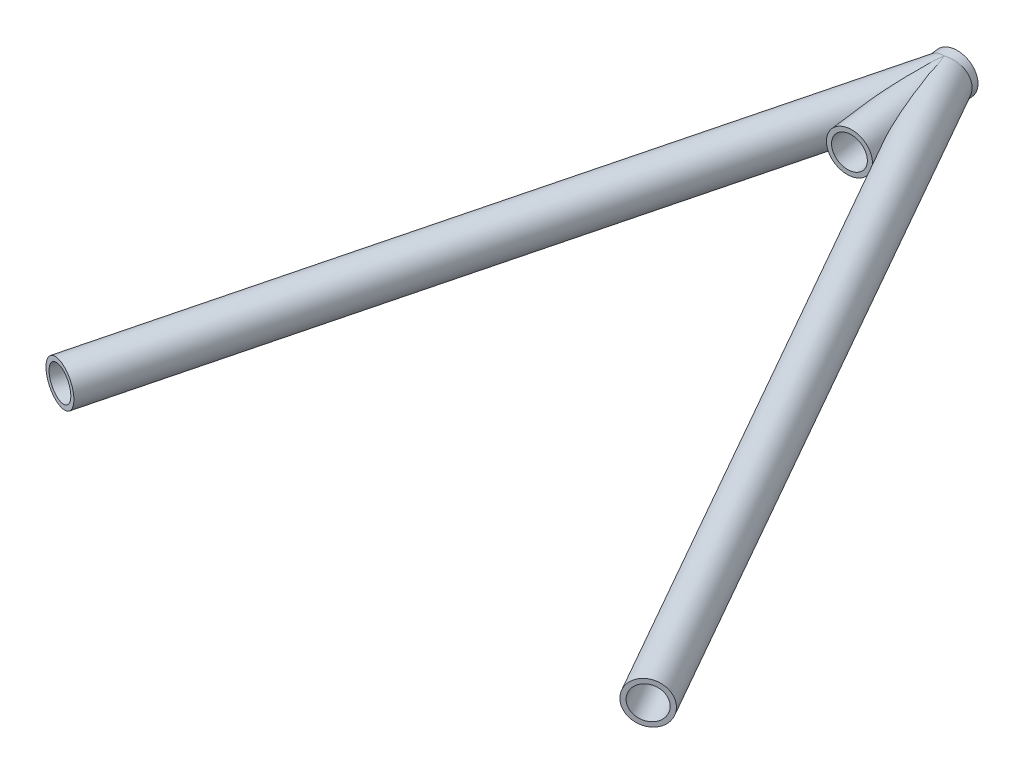
ISO-10303-21;
HEADER;
FILE_DESCRIPTION(('STEP AP214'),'2;1');
FILE_NAME('part.step','',(''),(''),'','','');
FILE_SCHEMA(('AUTOMOTIVE_DESIGN { 1 0 10303 214 1 1 1 1 }'));
ENDSEC;
DATA;
#1=APPLICATION_CONTEXT('core data for automotive mechanical design processes');
#2=APPLICATION_PROTOCOL_DEFINITION('international standard','automotive_design',2000,#1);
#3=PRODUCT_CONTEXT('',#1,'mechanical');
#4=PRODUCT('Part','Part','',(#3));
#5=PRODUCT_RELATED_PRODUCT_CATEGORY('part','',(#4));
#6=PRODUCT_DEFINITION_FORMATION('','',#4);
#7=PRODUCT_DEFINITION_CONTEXT('part definition',#1,'design');
#8=PRODUCT_DEFINITION('design','',#6,#7);
#9=PRODUCT_DEFINITION_SHAPE('','',#8);
#10=(LENGTH_UNIT() NAMED_UNIT(*) SI_UNIT(.MILLI.,.METRE.));
#11=(NAMED_UNIT(*) PLANE_ANGLE_UNIT() SI_UNIT($,.RADIAN.));
#12=(NAMED_UNIT(*) SI_UNIT($,.STERADIAN.) SOLID_ANGLE_UNIT());
#13=UNCERTAINTY_MEASURE_WITH_UNIT(LENGTH_MEASURE(1.E-05),#10,'distance_accuracy_value','');
#14=(GEOMETRIC_REPRESENTATION_CONTEXT(3) GLOBAL_UNCERTAINTY_ASSIGNED_CONTEXT((#13)) GLOBAL_UNIT_ASSIGNED_CONTEXT((#10,
#11,#12)) REPRESENTATION_CONTEXT('',''));
#15=CARTESIAN_POINT('',(0.,0.,0.));
#16=DIRECTION('',(0.,0.,1.));
#17=DIRECTION('',(1.,0.,0.));
#18=AXIS2_PLACEMENT_3D('',#15,#16,#17);
#19=CARTESIAN_POINT('',(3.75423528508093,133.137476358284,-665.631869893479));
#20=DIRECTION('',(0.49375074260803,-0.000241320421330066,0.86960344177014));
#21=DIRECTION('',(0.869603467091057,0.,-0.493750756984952));
#22=AXIS2_PLACEMENT_3D('',#19,#20,#21);
#23=CYLINDRICAL_SURFACE('',#22,7.4168);
#24=CARTESIAN_POINT('',(182.718724008719,133.050007556528,-350.436120461955));
#25=DIRECTION('',(-0.49375074260803,0.000241320421330099,-0.86960344177014));
#26=DIRECTION('',(-0.869603467091057,0.,0.493750756984952));
#27=AXIS2_PLACEMENT_3D('',#24,#25,#26);
#28=CIRCLE('',#27,7.4168);
#29=CARTESIAN_POINT('',(176.269049013998,133.050007556528,-346.774069847549));
#30=VERTEX_POINT('',#29);
#31=EDGE_CURVE('E109',#30,#30,#28,.T.);
#32=ORIENTED_EDGE('',*,*,#31,.F.);
#33=EDGE_LOOP('',(#32));
#34=FACE_BOUND('',#33,.T.);
#35=CARTESIAN_POINT('',(13.6086546072393,133.135812291246,-663.297418366241));
#36=CARTESIAN_POINT('',(13.6102435157583,132.943696286205,-663.294620419258));
#37=CARTESIAN_POINT('',(13.6066690576741,132.751629390176,-663.285786293646));
#38=CARTESIAN_POINT('',(13.5893625437771,132.368906550424,-663.255934631927));
#39=CARTESIAN_POINT('',(13.5756307597827,132.178250569081,-663.234917421853));
#40=CARTESIAN_POINT('',(13.5383840501864,131.799686158064,-663.18052162104));
#41=CARTESIAN_POINT('',(13.5148696740601,131.611777574685,-663.147143724597));
#42=CARTESIAN_POINT('',(13.4586480537573,131.240035038748,-663.067787849124));
#43=CARTESIAN_POINT('',(13.4259407536838,131.056201110973,-663.02180979348));
#44=CARTESIAN_POINT('',(13.3520880992867,130.693630260555,-662.91687980293));
#45=CARTESIAN_POINT('',(13.3109275200954,130.514903206723,-662.857904444888));
#46=CARTESIAN_POINT('',(13.2212805452743,130.16425714513,-662.726738906455));
#47=CARTESIAN_POINT('',(13.1727941403516,129.992338146004,-662.654548709301));
#48=CARTESIAN_POINT('',(13.0698554429603,129.656731838677,-662.496738700705));
#49=CARTESIAN_POINT('',(13.0154057517197,129.493040986401,-662.411124737827));
#50=CARTESIAN_POINT('',(12.9021198522644,129.175119576387,-662.226306344621));
#51=CARTESIAN_POINT('',(12.8432838294249,129.020888619356,-662.127102488481));
#52=CARTESIAN_POINT('',(12.7249114712971,128.7276943423,-661.918441342211));
#53=CARTESIAN_POINT('',(12.6654530788384,128.588406347137,-661.809396079809));
#54=CARTESIAN_POINT('',(12.5459386252434,128.320775840413,-661.578909036197));
#55=CARTESIAN_POINT('',(12.4858825886566,128.192432881314,-661.457467762301));
#56=CARTESIAN_POINT('',(12.3670414906169,127.947432884083,-661.202867662702));
#57=CARTESIAN_POINT('',(12.308255893457,127.830770841963,-661.069713900832));
#58=CARTESIAN_POINT('',(12.193675505941,127.609438879757,-660.792603609228));
#59=CARTESIAN_POINT('',(12.1378806783114,127.504768810198,-660.648647214179));
#60=CARTESIAN_POINT('',(12.0330497537361,127.311585644815,-660.357470136293));
#61=CARTESIAN_POINT('',(11.9838277485131,127.222576941279,-660.210643957389));
#62=CARTESIAN_POINT('',(11.8905270447521,127.055232389319,-659.909497466283));
#63=CARTESIAN_POINT('',(11.8464481329878,126.976896098409,-659.755177465141));
#64=CARTESIAN_POINT('',(11.7641118296804,126.830303226896,-659.440347613243));
#65=CARTESIAN_POINT('',(11.7258543455774,126.76204648603,-659.279837860954));
#66=CARTESIAN_POINT('',(11.6554962190303,126.634828071231,-658.953876245638));
#67=CARTESIAN_POINT('',(11.6233963345776,126.575867541806,-658.788423777063));
#68=CARTESIAN_POINT('',(11.5450717749549,126.427877832954,-658.33609731047));
#69=CARTESIAN_POINT('',(11.5047637170453,126.346819050203,-658.045568590235));
#70=CARTESIAN_POINT('',(11.4412056524005,126.204598993557,-657.457846524422));
#71=CARTESIAN_POINT('',(11.4179684539771,126.143452679151,-657.160648346671));
#72=CARTESIAN_POINT('',(11.3865566881718,126.036870591985,-656.561411265903));
#73=CARTESIAN_POINT('',(11.3784473252225,125.991503510962,-656.259357042143));
#74=CARTESIAN_POINT('',(11.3761141923393,125.933075842372,-655.805129853787));
#75=CARTESIAN_POINT('',(11.3769743384554,125.915205199458,-655.653546370845));
#76=CARTESIAN_POINT('',(11.381710960775,125.88233550764,-655.350111598786));
#77=CARTESIAN_POINT('',(11.3855874493409,125.867336470506,-655.198260308574));
#78=CARTESIAN_POINT('',(11.3993431256962,125.831479250857,-654.801059677835));
#79=CARTESIAN_POINT('',(11.4114472237281,125.812684955806,-654.555600404177));
#80=CARTESIAN_POINT('',(11.4419305208802,125.780748821526,-654.06468918603));
#81=CARTESIAN_POINT('',(11.4603106197901,125.767607793416,-653.819237247642));
#82=CARTESIAN_POINT('',(11.5025320670153,125.746152432103,-653.328474457607));
#83=CARTESIAN_POINT('',(11.5263761840825,125.737840553524,-653.083163740916));
#84=CARTESIAN_POINT('',(11.5788145912336,125.725405955124,-652.592938514377));
#85=CARTESIAN_POINT('',(11.6074091896892,125.721283507379,-652.348024031294));
#86=CARTESIAN_POINT('',(11.6995159018464,125.714388202832,-651.612928002518));
#87=CARTESIAN_POINT('',(11.7692529026552,125.717129458216,-651.12346900276));
#88=CARTESIAN_POINT('',(11.921368028926,125.734329579169,-650.146927999857));
#89=CARTESIAN_POINT('',(12.0037429282855,125.748785458344,-649.659845422728));
#90=CARTESIAN_POINT('',(12.1786900475808,125.787685297371,-648.685884922059));
#91=CARTESIAN_POINT('',(12.2713023908143,125.812169653435,-648.199015893255));
#92=CARTESIAN_POINT('',(12.4643235736586,125.869992358011,-647.22734302503));
#93=CARTESIAN_POINT('',(12.5647328440914,125.903331196027,-646.742539301293));
#94=CARTESIAN_POINT('',(12.771598946191,125.9781577449,-645.775528433244));
#95=CARTESIAN_POINT('',(12.878047704712,126.019634751546,-645.293318723905));
#96=CARTESIAN_POINT('',(13.0958727535896,126.11045505788,-644.330777891784));
#97=CARTESIAN_POINT('',(13.2072489120966,126.159798147176,-643.85044671911));
#98=CARTESIAN_POINT('',(13.4948496122562,126.294898520002,-642.633950000163));
#99=CARTESIAN_POINT('',(13.6737611085542,126.385975395546,-641.899005148523));
#100=CARTESIAN_POINT('',(14.0381924208502,126.587411388771,-640.433154303958));
#101=CARTESIAN_POINT('',(14.2237142358585,126.697776379405,-639.702249611332));
#102=CARTESIAN_POINT('',(14.5050182438505,126.879192564816,-638.610583869734));
#103=CARTESIAN_POINT('',(14.5991387665726,126.942197445056,-638.24804609261));
#104=CARTESIAN_POINT('',(14.7882467543667,127.073947064027,-637.524244307809));
#105=CARTESIAN_POINT('',(14.8832342038424,127.14269169968,-637.162980277378));
#106=CARTESIAN_POINT('',(15.0738266780298,127.286421605985,-636.441937517069));
#107=CARTESIAN_POINT('',(15.1694315728763,127.361405601385,-636.082158499373));
#108=CARTESIAN_POINT('',(15.361041554355,127.518298380359,-635.364228324397));
#109=CARTESIAN_POINT('',(15.4570466304916,127.600206983393,-635.006077124933));
#110=CARTESIAN_POINT('',(15.6695095433893,127.789938554064,-634.216212032073));
#111=CARTESIAN_POINT('',(15.7860037127206,127.899580659242,-633.784940831252));
#112=CARTESIAN_POINT('',(16.018720723797,128.1324063551,-632.925876710485));
#113=CARTESIAN_POINT('',(16.1349435052178,128.255592708991,-632.498084519493));
#114=CARTESIAN_POINT('',(16.3666326044546,128.518727638981,-631.646517396067));
#115=CARTESIAN_POINT('',(16.4820972480334,128.658705094366,-631.222750777843));
#116=CARTESIAN_POINT('',(16.653762249178,128.884588031495,-630.59248495956));
#117=CARTESIAN_POINT('',(16.710718820979,128.962520206554,-630.383329595457));
#118=CARTESIAN_POINT('',(16.8239361408098,129.124552061024,-629.967239242773));
#119=CARTESIAN_POINT('',(16.8801969495779,129.20865119757,-629.760304060589));
#120=CARTESIAN_POINT('',(16.9920135768224,129.384461478673,-629.348379894913));
#121=CARTESIAN_POINT('',(17.0475653934524,129.476203393559,-629.143402887426));
#122=CARTESIAN_POINT('',(17.1573801861085,129.668481490551,-628.737133886553));
#123=CARTESIAN_POINT('',(17.211642701339,129.769020758456,-628.535843216385));
#124=CARTESIAN_POINT('',(17.3181130413428,129.98046060205,-628.139222305527));
#125=CARTESIAN_POINT('',(17.3703279500728,130.091319948049,-627.943872160899));
#126=CARTESIAN_POINT('',(17.4720539341331,130.326435860247,-627.560751266634));
#127=CARTESIAN_POINT('',(17.5215673717822,130.450680429341,-627.372973933643));
#128=CARTESIAN_POINT('',(17.6021038692364,130.676436552347,-627.064124360761));
#129=CARTESIAN_POINT('',(17.6341879406363,130.773448653534,-626.940062923778));
#130=CARTESIAN_POINT('',(17.6955860126308,130.978126094349,-626.699782509526));
#131=CARTESIAN_POINT('',(17.7248951536827,131.085809470916,-626.583577388607));
#132=CARTESIAN_POINT('',(17.7796688606891,131.315154114233,-626.362044988811));
#133=CARTESIAN_POINT('',(17.8050911311566,131.436946835604,-626.256840847838));
#134=CARTESIAN_POINT('',(17.8495158236233,131.695934674998,-626.065686785233));
#135=CARTESIAN_POINT('',(17.8685387687971,131.833078637288,-625.979675614789));
#136=CARTESIAN_POINT('',(17.8917115495539,132.06918836183,-625.863849875242));
#137=CARTESIAN_POINT('',(17.8987614568092,132.163400174659,-625.825030027491));
#138=CARTESIAN_POINT('',(17.9081851545971,132.356888165458,-625.76230046231));
#139=CARTESIAN_POINT('',(17.9105655117314,132.456157029916,-625.738369839166));
#140=CARTESIAN_POINT('',(17.9100284143125,132.658054018629,-625.707766460941));
#141=CARTESIAN_POINT('',(17.9070758689609,132.760699998131,-625.701208721281));
#142=CARTESIAN_POINT('',(17.8957781926082,132.965260004829,-625.706322989759));
#143=CARTESIAN_POINT('',(17.8874304624642,133.067173655285,-625.718003788199));
#144=CARTESIAN_POINT('',(17.866778754469,133.259840862116,-625.75645426341));
#145=CARTESIAN_POINT('',(17.8548038066008,133.350869004817,-625.782074044116));
#146=CARTESIAN_POINT('',(17.8275607639484,133.528119823033,-625.845168348178));
#147=CARTESIAN_POINT('',(17.8122916199545,133.614340956468,-625.882646650282));
#148=CARTESIAN_POINT('',(17.7661235975256,133.847697926776,-626.000401462534));
#149=CARTESIAN_POINT('',(17.7324233318203,133.988998526671,-626.091066180696));
#150=CARTESIAN_POINT('',(17.6601337750247,134.255952832412,-626.291528389755));
#151=CARTESIAN_POINT('',(17.6215261903194,134.381544310314,-626.401398080043));
#152=CARTESIAN_POINT('',(17.5296122700668,134.654552523155,-626.667403026716));
#153=CARTESIAN_POINT('',(17.4753164567288,134.797563661048,-626.827655410108));
#154=CARTESIAN_POINT('',(17.3639206150107,135.067085956773,-627.160745879943));
#155=CARTESIAN_POINT('',(17.3068152181757,135.193563692967,-627.333608391557));
#156=CARTESIAN_POINT('',(17.1906783077242,135.434160532985,-627.688378364864));
#157=CARTESIAN_POINT('',(17.1316385753243,135.548214522415,-627.870326815258));
#158=CARTESIAN_POINT('',(17.0125987828536,135.76581525633,-628.239779192347));
#159=CARTESIAN_POINT('',(16.9525996845245,135.869371842787,-628.427277698333));
#160=CARTESIAN_POINT('',(16.8379452532912,136.058167503616,-628.787669785946));
#161=CARTESIAN_POINT('',(16.7833500823083,136.144204668453,-628.960167642796));
#162=CARTESIAN_POINT('',(16.6738167086596,136.310444558941,-629.307852852936));
#163=CARTESIAN_POINT('',(16.618878472766,136.390646709616,-629.483040469218));
#164=CARTESIAN_POINT('',(16.4537000312348,136.623820484157,-630.011977159066));
#165=CARTESIAN_POINT('',(16.3431459408628,136.769279390334,-630.368943134666));
#166=CARTESIAN_POINT('',(16.1216677789608,137.045002209726,-631.089425612174));
#167=CARTESIAN_POINT('',(16.0107434203679,137.175233188439,-631.452954418302));
#168=CARTESIAN_POINT('',(15.7891462248987,137.423135381394,-632.184369923435));
#169=CARTESIAN_POINT('',(15.678473416169,137.540805251908,-632.552257084008));
#170=CARTESIAN_POINT('',(15.4574366681595,137.765918076101,-633.292223000904));
#171=CARTESIAN_POINT('',(15.3470740340911,137.873336762449,-633.664309480258));
#172=CARTESIAN_POINT('',(15.127150616958,138.079163288941,-634.411214893228));
#173=CARTESIAN_POINT('',(15.0175898788865,138.177570626984,-634.786033977847));
#174=CARTESIAN_POINT('',(14.7996448261579,138.366370144409,-635.53742290969));
#175=CARTESIAN_POINT('',(14.6912590923869,138.456773235393,-635.913989613348));
#176=CARTESIAN_POINT('',(14.475720802885,138.63057209485,-636.669087842408));
#177=CARTESIAN_POINT('',(14.3685682662606,138.713967754879,-637.047619398122));
#178=CARTESIAN_POINT('',(14.1004479556874,138.916082852716,-638.003447086399));
#179=CARTESIAN_POINT('',(13.9404283025361,139.030657946074,-638.581887926304));
#180=CARTESIAN_POINT('',(13.6245897120992,139.246869276464,-639.742338218555));
#181=CARTESIAN_POINT('',(13.4687709695469,139.348504914496,-640.324347834803));
#182=CARTESIAN_POINT('',(13.1622245357466,139.540008510908,-641.492303742559));
#183=CARTESIAN_POINT('',(13.0115023639876,139.629863996537,-642.07825352696));
#184=CARTESIAN_POINT('',(12.7166647284632,139.798281245158,-643.253408916733));
#185=CARTESIAN_POINT('',(12.5725490108277,139.87684344237,-643.842614396019));
#186=CARTESIAN_POINT('',(12.2932562085905,140.022508656525,-645.022019427297));
#187=CARTESIAN_POINT('',(12.1580455296245,140.089656455896,-645.612205468665));
#188=CARTESIAN_POINT('',(11.8982859376156,140.212476076049,-646.796220397976));
#189=CARTESIAN_POINT('',(11.7737383002559,140.268146524846,-647.390049712704));
#190=CARTESIAN_POINT('',(11.5975413384035,140.342103950557,-648.28331266253));
#191=CARTESIAN_POINT('',(11.5406092287809,140.365154616146,-648.58131604653));
#192=CARTESIAN_POINT('',(11.4308193625709,140.407828317647,-649.178313994406));
#193=CARTESIAN_POINT('',(11.3779614859032,140.427451454601,-649.477308528797));
#194=CARTESIAN_POINT('',(11.2769872451166,140.46292724638,-650.07625310869));
#195=CARTESIAN_POINT('',(11.2288697923269,140.478780768112,-650.376202918395));
#196=CARTESIAN_POINT('',(11.138166163339,140.506257882043,-650.977122398926));
#197=CARTESIAN_POINT('',(11.0955796245221,140.517881751639,-651.278092001564));
#198=CARTESIAN_POINT('',(11.0326765117404,140.532583571745,-651.760235850056));
#199=CARTESIAN_POINT('',(11.0102738042889,140.537219555616,-651.941091074691));
#200=CARTESIAN_POINT('',(10.9680587612226,140.544566841023,-652.303140083969));
#201=CARTESIAN_POINT('',(10.9482464129427,140.547278151971,-652.484333866953));
#202=CARTESIAN_POINT('',(10.893092793489,140.552230473486,-653.028458797582));
#203=CARTESIAN_POINT('',(10.8620418455926,140.551288185937,-653.39188180954));
#204=CARTESIAN_POINT('',(10.8140302824725,140.53875698168,-654.119473256322));
#205=CARTESIAN_POINT('',(10.7970679636685,140.527169352551,-654.483641595682));
#206=CARTESIAN_POINT('',(10.7805385956098,140.490241292133,-655.211696267821));
#207=CARTESIAN_POINT('',(10.7809656123947,140.464905555179,-655.575582654428));
#208=CARTESIAN_POINT('',(10.7996604814402,140.406767632614,-656.187954070913));
#209=CARTESIAN_POINT('',(10.8123261006012,140.378753968375,-656.43705712924));
#210=CARTESIAN_POINT('',(10.8491044125988,140.312185179117,-656.933074581053));
#211=CARTESIAN_POINT('',(10.8732176516205,140.273629551161,-657.179988869539));
#212=CARTESIAN_POINT('',(10.9340712879515,140.183815500964,-657.669450968339));
#213=CARTESIAN_POINT('',(10.9707856437523,140.132583336557,-657.912006706637));
#214=CARTESIAN_POINT('',(11.0577228384679,140.014838925864,-658.390928758306));
#215=CARTESIAN_POINT('',(11.1079406428072,139.94833237577,-658.627297342504));
#216=CARTESIAN_POINT('',(11.2079646428968,139.815981680827,-659.033981779209));
#217=CARTESIAN_POINT('',(11.2548463566336,139.753981820254,-659.206269867957));
#218=CARTESIAN_POINT('',(11.3559441635559,139.61881791541,-659.544169100685));
#219=CARTESIAN_POINT('',(11.4101582360909,139.545656946208,-659.709782067929));
#220=CARTESIAN_POINT('',(11.5250837093319,139.387408826185,-660.032782110745));
#221=CARTESIAN_POINT('',(11.5857922978034,139.302326832465,-660.190172703153));
#222=CARTESIAN_POINT('',(11.7124551559932,139.119744864638,-660.495370043563));
#223=CARTESIAN_POINT('',(11.7784094849009,139.022244750406,-660.643176683391));
#224=CARTESIAN_POINT('',(11.914180215819,138.814333549254,-660.928533707605));
#225=CARTESIAN_POINT('',(11.9840107072782,138.703873481699,-661.066041740377));
#226=CARTESIAN_POINT('',(12.1253851317037,138.470641916315,-661.329234252082));
#227=CARTESIAN_POINT('',(12.1969291113969,138.347870082454,-661.454918408115));
#228=CARTESIAN_POINT('',(12.3397752932093,138.090564224781,-661.693947979671));
#229=CARTESIAN_POINT('',(12.4110773161115,137.956022891981,-661.80728562838));
#230=CARTESIAN_POINT('',(12.5514541023836,137.676121743778,-662.021255812637));
#231=CARTESIAN_POINT('',(12.6205288998249,137.530762093985,-662.121888542609));
#232=CARTESIAN_POINT('',(12.7509818324116,137.238551393358,-662.305219209714));
#233=CARTESIAN_POINT('',(12.8125743366183,137.092222795274,-662.388599426097));
#234=CARTESIAN_POINT('',(12.9308698929848,136.791817132092,-662.544076718907));
#235=CARTESIAN_POINT('',(12.9875732247804,136.637740510939,-662.616174440829));
#236=CARTESIAN_POINT('',(13.0949800311171,136.322819654164,-662.749263467112));
#237=CARTESIAN_POINT('',(13.145682539886,136.161974334818,-662.810252984569));
#238=CARTESIAN_POINT('',(13.2401521948778,135.834570545958,-662.921298120616));
#239=CARTESIAN_POINT('',(13.2839188746257,135.668011693091,-662.971353003873));
#240=CARTESIAN_POINT('',(13.3685639704998,135.309949024613,-663.066064084194));
#241=CARTESIAN_POINT('',(13.4084656070514,135.117850202321,-663.109351716526));
#242=CARTESIAN_POINT('',(13.4778467722152,134.729273212127,-663.182623860937));
#243=CARTESIAN_POINT('',(13.5073253133268,134.532794631153,-663.212607112607));
#244=CARTESIAN_POINT('',(13.555337457324,134.136917436385,-663.259398394504));
#245=CARTESIAN_POINT('',(13.5738691228693,133.937518312119,-663.276204092784));
#246=CARTESIAN_POINT('',(13.599697300863,133.537332300061,-663.296675441438));
#247=CARTESIAN_POINT('',(13.6069944296405,133.336545489005,-663.300341812651));
#248=CARTESIAN_POINT('',(13.6086546072393,133.135812291246,-663.297418366241));
#249=B_SPLINE_CURVE_WITH_KNOTS('',3,(#35,#36,#37,#38,#39,#40,#41,#42,#43,#44,#45,#46,#47,#48,
#49,#50,#51,#52,#53,#54,#55,#56,#57,#58,#59,#60,#61,#62,#63,#64,#65,#66,#67,#68,#69,#70,#71,#72,
#73,#74,#75,#76,#77,#78,#79,#80,#81,#82,#83,#84,#85,#86,#87,#88,#89,#90,#91,#92,#93,#94,#95,#96,
#97,#98,#99,#100,#101,#102,#103,#104,#105,#106,#107,#108,#109,#110,#111,#112,#113,#114,#115,
#116,#117,#118,#119,#120,#121,#122,#123,#124,#125,#126,#127,#128,#129,#130,#131,#132,#133,#134,
#135,#136,#137,#138,#139,#140,#141,#142,#143,#144,#145,#146,#147,#148,#149,#150,#151,#152,#153,
#154,#155,#156,#157,#158,#159,#160,#161,#162,#163,#164,#165,#166,#167,#168,#169,#170,#171,#172,
#173,#174,#175,#176,#177,#178,#179,#180,#181,#182,#183,#184,#185,#186,#187,#188,#189,#190,#191,
#192,#193,#194,#195,#196,#197,#198,#199,#200,#201,#202,#203,#204,#205,#206,#207,#208,#209,#210,
#211,#212,#213,#214,#215,#216,#217,#218,#219,#220,#221,#222,#223,#224,#225,#226,#227,#228,#229,
#230,#231,#232,#233,#234,#235,#236,#237,#238,#239,#240,#241,#242,#243,#244,#245,#246,#247,#248),
.UNSPECIFIED.,.T.,.F.,(4,2,2,2,2,2,2,2,2,2,2,2,2,2,2,2,2,2,2,2,2,2,2,2,2,2,2,2,2,2,2,2,2,2,2,2,
2,2,2,2,2,2,2,2,2,2,2,2,2,2,2,2,2,2,2,2,2,2,2,2,2,2,2,2,2,2,2,2,2,2,2,2,2,2,2,2,2,2,2,2,2,2,2,2,
2,2,2,2,2,2,2,2,2,2,2,2,2,2,2,2,2,2,2,2,2,2,4),(0.,0.576257522450247,1.15249962433111,
1.72870936380165,2.3049226069419,2.88218289228343,3.45944390988877,4.03645411755667,
4.61343995340236,5.17258017470829,5.73169752209311,6.29057431511023,6.84944414130359,
7.38471560797734,7.91996487506497,8.45520563087696,8.990512231804,9.90183350984317,
10.81383785828,11.7297641518732,12.1876276741563,12.6454930729813,13.384736498608,
14.1240859540465,14.8638108876773,15.6035838584319,17.0863677439679,18.5687737440807,
20.0572107613525,21.545730081357,23.0323045059726,24.5188391761482,26.8041635940289,
29.0901850766531,30.2296022051011,31.3689988754548,32.5081632358964,33.6472979050552,
35.0270711805351,36.4071264725146,37.7895903254869,38.4805820592335,39.171513039174,
39.8653742989993,40.5594799238148,41.2509226920134,41.9417508000338,42.4235107461619,
42.9060993366719,43.3936137522666,43.8795494209243,44.1848867715463,44.489794429776,
44.7967157116883,45.1037849639774,45.3886913410789,45.6736885958934,46.184389621879,
46.6970535805094,47.3601110624247,48.0244888187825,48.6921962312096,49.35927172077,
49.9601902134685,50.5611678401415,51.7636715310591,52.9687296528557,54.1739165569493,
55.3818891494722,56.589929007742,57.7962958282865,59.0026813145072,60.8355067240752,
62.6684169487228,64.503252437806,66.3380173593834,68.165408877834,69.9930187134273,
70.9057825505669,71.818519475434,72.7310462929807,73.6435132530691,74.190375795066,
74.7372356631819,75.8311119120261,76.9248558714026,78.0182266032507,78.7708083476697,
79.523426002626,80.2744975683907,81.0252894947685,81.5917963080054,82.1581473202686,
82.7242540781492,83.2903672244928,83.8586933757519,84.4270350429442,84.9957321967822,
85.5644206467227,86.1018080526181,86.6391647022671,87.1766077168023,87.7140868621947,
88.3160614080905,88.9180929707451,89.5202310469822,90.1223360886182),.UNSPECIFIED.);
#250=CARTESIAN_POINT('',(13.6086546072393,133.135812291246,-663.297418366241));
#251=VERTEX_POINT('',#250);
#252=EDGE_CURVE('E83',#251,#251,#249,.T.);
#253=ORIENTED_EDGE('',*,*,#252,.T.);
#254=EDGE_LOOP('',(#253));
#255=FACE_BOUND('',#254,.T.);
#256=ADVANCED_FACE('F65',(#34,#255),#23,.F.);
#257=CARTESIAN_POINT('',(9.44247056550694,132.205085243906,-615.965234954071));
#258=DIRECTION('',(-0.113764705608517,0.018647822287539,-0.993332698788145));
#259=DIRECTION('',(-0.99350545523548,0.,0.113784491110793));
#260=AXIS2_PLACEMENT_3D('',#257,#258,#259);
#261=CYLINDRICAL_SURFACE('',#260,9.525);
#262=ORIENTED_EDGE('',*,*,#252,.F.);
#263=EDGE_LOOP('',(#262));
#264=FACE_BOUND('',#263,.T.);
#265=CARTESIAN_POINT('',(3.75423528508111,133.137476358283,-665.631869893478));
#266=DIRECTION('',(0.949854925607184,0.0460109181876038,-0.309287270522575));
#267=DIRECTION('',(0.310022927269246,-0.0096393718602572,0.950680212835813));
#268=AXIS2_PLACEMENT_3D('',#265,#266,#267);
#269=ELLIPSE('',#268,47.6194769568337,9.52499999999999);
#270=CARTESIAN_POINT('',(4.14247747103312,123.623006933356,-665.854949626237));
#271=VERTEX_POINT('',#270);
#272=CARTESIAN_POINT('',(3.36599309912909,142.651945783211,-665.40879016072));
#273=VERTEX_POINT('',#272);
#274=EDGE_CURVE('E74',#271,#273,#269,.F.);
#275=ORIENTED_EDGE('',*,*,#274,.T.);
#276=CARTESIAN_POINT('',(3.75423528508111,133.137476358283,-665.631869893478));
#277=DIRECTION('',(0.310022927269246,-0.0096393718602572,0.950680212835813));
#278=DIRECTION('',(0.949854925607184,0.0460109181876038,-0.309287270522575));
#279=AXIS2_PLACEMENT_3D('',#276,#277,#278);
#280=ELLIPSE('',#279,9.72145939962004,9.52499999999999);
#281=EDGE_CURVE('E13',#273,#271,#280,.F.);
#282=ORIENTED_EDGE('',*,*,#281,.T.);
#283=EDGE_LOOP('',(#275,#282));
#284=FACE_BOUND('',#283,.T.);
#285=ADVANCED_FACE('F81',(#264,#284),#261,.F.);
#286=CARTESIAN_POINT('',(3.75423528508093,133.137476358284,-665.631869893479));
#287=DIRECTION('',(0.49375074260803,-0.000241320421330066,0.86960344177014));
#288=DIRECTION('',(0.869603467091057,0.,-0.493750756984952));
#289=AXIS2_PLACEMENT_3D('',#286,#287,#288);
#290=CYLINDRICAL_SURFACE('',#289,9.52499999999998);
#291=CARTESIAN_POINT('',(182.718724008719,133.050007556528,-350.436120461955));
#292=DIRECTION('',(-0.49375074260803,0.000241320421330099,-0.86960344177014));
#293=DIRECTION('',(-0.869603467091057,0.,0.493750756984952));
#294=AXIS2_PLACEMENT_3D('',#291,#292,#293);
#295=CIRCLE('',#294,9.52499999999998);
#296=CARTESIAN_POINT('',(174.435750984677,133.050007556528,-345.733144501674));
#297=VERTEX_POINT('',#296);
#298=EDGE_CURVE('E69',#297,#297,#295,.T.);
#299=ORIENTED_EDGE('',*,*,#298,.T.);
#300=EDGE_LOOP('',(#299));
#301=FACE_BOUND('',#300,.T.);
#302=ORIENTED_EDGE('',*,*,#274,.F.);
#303=ORIENTED_EDGE('',*,*,#281,.F.);
#304=EDGE_LOOP('',(#302,#303));
#305=FACE_BOUND('',#304,.T.);
#306=ADVANCED_FACE('F67',(#301,#305),#290,.T.);
#307=CARTESIAN_POINT('',(182.718724008719,133.050007556528,-350.436120461955));
#308=DIRECTION('',(-0.49375074260803,0.000241320421330099,-0.86960344177014));
#309=DIRECTION('',(-0.869603467091057,0.,0.493750756984952));
#310=AXIS2_PLACEMENT_3D('',#307,#308,#309);
#311=PLANE('',#310);
#312=ORIENTED_EDGE('',*,*,#31,.T.);
#313=EDGE_LOOP('',(#312));
#314=FACE_BOUND('',#313,.T.);
#315=ORIENTED_EDGE('',*,*,#298,.F.);
#316=EDGE_LOOP('',(#315));
#317=FACE_BOUND('',#316,.T.);
#318=ADVANCED_FACE('F86',(#314,#317),#311,.F.);
#319=CLOSED_SHELL('',(#256,#285,#306,#318));
#320=MANIFOLD_SOLID_BREP('B2',#319);
#321=CARTESIAN_POINT('',(-99.9999999999999,120.799926986381,-320.));
#322=DIRECTION('',(0.28734441952249,0.0341684939690268,-0.957217686103413));
#323=DIRECTION('',(-0.95777694496046,0.,-0.287512301827606));
#324=AXIS2_PLACEMENT_3D('',#321,#322,#323);
#325=CYLINDRICAL_SURFACE('',#324,7.4168);
#326=CARTESIAN_POINT('',(-89.9429453167127,121.995824275297,-353.50261901362));
#327=DIRECTION('',(0.28734441952249,0.0341684939690268,-0.957217686103413));
#328=DIRECTION('',(-0.95777694496046,0.,-0.287512301827606));
#329=AXIS2_PLACEMENT_3D('',#326,#327,#328);
#330=CIRCLE('',#329,7.4168);
#331=CARTESIAN_POINT('',(-97.0465853620954,121.995824275297,-355.635040253815));
#332=VERTEX_POINT('',#331);
#333=EDGE_CURVE('E184',#332,#332,#330,.T.);
#334=ORIENTED_EDGE('',*,*,#333,.F.);
#335=EDGE_LOOP('',(#334));
#336=FACE_BOUND('',#335,.T.);
#337=CARTESIAN_POINT('',(-5.32280045840875,132.90281734134,-661.190405804536));
#338=CARTESIAN_POINT('',(-5.32532446511033,133.095076571401,-661.181993459531));
#339=CARTESIAN_POINT('',(-5.32143391096337,133.287263711764,-661.168877389668));
#340=CARTESIAN_POINT('',(-5.30091999978784,133.670150425419,-661.133159242241));
#341=CARTESIAN_POINT('',(-5.28428976515265,133.860849138979,-661.110552043804));
#342=CARTESIAN_POINT('',(-5.23853391932889,134.239762989633,-661.055598658993));
#343=CARTESIAN_POINT('',(-5.20938111917786,134.42797179876,-661.023231327276));
#344=CARTESIAN_POINT('',(-5.13906854033556,134.800106487093,-660.948475187571));
#345=CARTESIAN_POINT('',(-5.09790894283656,134.984032430886,-660.906086530814));
#346=CARTESIAN_POINT('',(-5.00425602719279,135.346367333121,-660.81085344079));
#347=CARTESIAN_POINT('',(-4.95175423348311,135.524772051175,-660.758001190984));
#348=CARTESIAN_POINT('',(-4.83638164170908,135.874539137095,-660.641386172527));
#349=CARTESIAN_POINT('',(-4.77351046030474,136.045901244316,-660.577623000514));
#350=CARTESIAN_POINT('',(-4.63867773993233,136.380034614311,-660.438749195182));
#351=CARTESIAN_POINT('',(-4.56672502794871,136.542814004303,-660.363649566861));
#352=CARTESIAN_POINT('',(-4.41517183996874,136.858615779354,-660.201585548859));
#353=CARTESIAN_POINT('',(-4.33557174213389,137.011638646248,-660.114621745768));
#354=CARTESIAN_POINT('',(-4.17294225291962,137.302301772491,-659.931238933771));
#355=CARTESIAN_POINT('',(-4.09008503812704,137.440264001794,-659.835177655319));
#356=CARTESIAN_POINT('',(-3.92065993967033,137.704852416657,-659.631420456186));
#357=CARTESIAN_POINT('',(-3.834092196095,137.831479029629,-659.523724974515));
#358=CARTESIAN_POINT('',(-3.65923815414095,138.072608523466,-659.296895159342));
#359=CARTESIAN_POINT('',(-3.57095255229404,138.187116201678,-659.177765388047));
#360=CARTESIAN_POINT('',(-3.39459612414685,138.403647505513,-658.92852133138));
#361=CARTESIAN_POINT('',(-3.30652529345782,138.50567138837,-658.798407272437));
#362=CARTESIAN_POINT('',(-3.13653424274035,138.692679424399,-658.534417106523));
#363=CARTESIAN_POINT('',(-3.05451998493761,138.778240776469,-658.401008910785));
#364=CARTESIAN_POINT('',(-2.89367346394761,138.938309961299,-658.125932283249));
#365=CARTESIAN_POINT('',(-2.81484105255959,139.01281830931,-657.984264236922));
#366=CARTESIAN_POINT('',(-2.66137702599043,139.151370913785,-657.693751340935));
#367=CARTESIAN_POINT('',(-2.58674524433827,139.215415585118,-657.544906776115));
#368=CARTESIAN_POINT('',(-2.44234730812666,139.333842948193,-657.241152286654));
#369=CARTESIAN_POINT('',(-2.37258177575441,139.38822440579,-657.086241590351));
#370=CARTESIAN_POINT('',(-2.19403094692563,139.521209155885,-656.667630678681));
#371=CARTESIAN_POINT('',(-2.08983304736065,139.592154597709,-656.399519386958));
#372=CARTESIAN_POINT('',(-1.89603637356109,139.714279775661,-655.85368896055));
#373=CARTESIAN_POINT('',(-1.80644804536858,139.765445404468,-655.575963121849));
#374=CARTESIAN_POINT('',(-1.64051381270443,139.852066418455,-655.012962870519));
#375=CARTESIAN_POINT('',(-1.56422470910485,139.887455376685,-654.727661801411));
#376=CARTESIAN_POINT('',(-1.45894149654571,139.93092894018,-654.296646151515));
#377=CARTESIAN_POINT('',(-1.42537500570984,139.943817690466,-654.152477863489));
#378=CARTESIAN_POINT('',(-1.36107642133819,139.966724846219,-653.863279404013));
#379=CARTESIAN_POINT('',(-1.33034434753158,139.976743231708,-653.718249226571));
#380=CARTESIAN_POINT('',(-1.25455445221917,139.9992465492,-653.343679031132));
#381=CARTESIAN_POINT('',(-1.21145367232595,140.009822968237,-653.113627881069));
#382=CARTESIAN_POINT('',(-1.13105159484138,140.025564962667,-652.652316161552));
#383=CARTESIAN_POINT('',(-1.09375110610913,140.030729783978,-652.421055428059));
#384=CARTESIAN_POINT('',(-1.02425813276692,140.036425177062,-651.957601227509));
#385=CARTESIAN_POINT('',(-0.992068188071652,140.036953451529,-651.725407355096));
#386=CARTESIAN_POINT('',(-0.932215971866535,140.033986602298,-651.260457055852));
#387=CARTESIAN_POINT('',(-0.904553994322714,140.030491217492,-651.027700593492));
#388=CARTESIAN_POINT('',(-0.827432808274786,140.014716511437,-650.32788048655));
#389=CARTESIAN_POINT('',(-0.783983515054542,139.997140966856,-649.860268010838));
#390=CARTESIAN_POINT('',(-0.709605477469021,139.950776902994,-648.924790175834));
#391=CARTESIAN_POINT('',(-0.678673664948811,139.921991134846,-648.456924906692));
#392=CARTESIAN_POINT('',(-0.626596907064288,139.854854115776,-647.51934763648));
#393=CARTESIAN_POINT('',(-0.605494149567917,139.816462699057,-647.049636245034));
#394=CARTESIAN_POINT('',(-0.571262345540276,139.731333486059,-646.110672071733));
#395=CARTESIAN_POINT('',(-0.558133710689445,139.684595259019,-645.641419314804));
#396=CARTESIAN_POINT('',(-0.538329411456542,139.583539062546,-644.704218581762));
#397=CARTESIAN_POINT('',(-0.531645402177449,139.529230999637,-644.236269702765));
#398=CARTESIAN_POINT('',(-0.523511960907571,139.413369523185,-643.301239295846));
#399=CARTESIAN_POINT('',(-0.522062413580554,139.351816269314,-642.834157749041));
#400=CARTESIAN_POINT('',(-0.523386671102324,139.22858982308,-641.951104402073));
#401=CARTESIAN_POINT('',(-0.525723646234277,139.1676393841,-641.535030609017));
#402=CARTESIAN_POINT('',(-0.533283417940708,139.040030771204,-640.703780416362));
#403=CARTESIAN_POINT('',(-0.538506249156633,138.97337252878,-640.288604027595));
#404=CARTESIAN_POINT('',(-0.55138921295042,138.834170227163,-639.459123459089));
#405=CARTESIAN_POINT('',(-0.55905022077207,138.761624061331,-639.044819646427));
#406=CARTESIAN_POINT('',(-0.576427800112162,138.610396757856,-638.217376754923));
#407=CARTESIAN_POINT('',(-0.586144364170691,138.531715642477,-637.804237671861));
#408=CARTESIAN_POINT('',(-0.607278678773326,138.368024454563,-636.980311661453));
#409=CARTESIAN_POINT('',(-0.618692194092135,138.283030394794,-636.569521449518));
#410=CARTESIAN_POINT('',(-0.642950441086956,138.106010187941,-635.749508106921));
#411=CARTESIAN_POINT('',(-0.655795138765475,138.013984207916,-635.340284939274));
#412=CARTESIAN_POINT('',(-0.682652026157147,137.82220965312,-634.523798676128));
#413=CARTESIAN_POINT('',(-0.696663908063554,137.722463114882,-634.116535093633));
#414=CARTESIAN_POINT('',(-0.725612367668741,137.514284512831,-633.304278327131));
#415=CARTESIAN_POINT('',(-0.740548904233738,137.40585283532,-632.899285043001));
#416=CARTESIAN_POINT('',(-0.771142325872506,137.178756908608,-632.091117771599));
#417=CARTESIAN_POINT('',(-0.786800885730658,137.060068246658,-631.687950670148));
#418=CARTESIAN_POINT('',(-0.818547813997315,136.810923878471,-630.88520160083));
#419=CARTESIAN_POINT('',(-0.834636248269107,136.680466361706,-630.48562019502));
#420=CARTESIAN_POINT('',(-0.866915583786615,136.405610434468,-629.692055395611));
#421=CARTESIAN_POINT('',(-0.883106237941042,136.261238480292,-629.298062950765));
#422=CARTESIAN_POINT('',(-0.907199453998482,136.031376992929,-628.712355363967));
#423=CARTESIAN_POINT('',(-0.915197343083074,135.952550654569,-628.518025285804));
#424=CARTESIAN_POINT('',(-0.931065797626531,135.789809365158,-628.131507591958));
#425=CARTESIAN_POINT('',(-0.938936369649505,135.705894677513,-627.93931986598));
#426=CARTESIAN_POINT('',(-0.957977379490109,135.493051888895,-627.471549334827));
#427=CARTESIAN_POINT('',(-0.969036169058006,135.360883041365,-627.197422978259));
#428=CARTESIAN_POINT('',(-0.990439730352056,135.080522878081,-626.656339217076));
#429=CARTESIAN_POINT('',(-1.00078246948724,134.932288788205,-626.389403436832));
#430=CARTESIAN_POINT('',(-1.01574831990034,134.687461461471,-625.987239666067));
#431=CARTESIAN_POINT('',(-1.02082554606325,134.598219806494,-625.84756099351));
#432=CARTESIAN_POINT('',(-1.03046904634924,134.412302212938,-625.573066530571));
#433=CARTESIAN_POINT('',(-1.03503505261665,134.315622421459,-625.438253314299));
#434=CARTESIAN_POINT('',(-1.04344936159375,134.113793678459,-625.175972268028));
#435=CARTESIAN_POINT('',(-1.04730071079703,134.008683546702,-625.048474937539));
#436=CARTESIAN_POINT('',(-1.05403781077358,133.787792627936,-624.80316301458));
#437=CARTESIAN_POINT('',(-1.0569248835489,133.672026729999,-624.685335333899));
#438=CARTESIAN_POINT('',(-1.06080218938585,133.456826337527,-624.490555848051));
#439=CARTESIAN_POINT('',(-1.06208157781466,133.360156542491,-624.410587162082));
#440=CARTESIAN_POINT('',(-1.06359836955809,133.158143298763,-624.262015058032));
#441=CARTESIAN_POINT('',(-1.06383489897855,133.052792650965,-624.193421218133));
#442=CARTESIAN_POINT('',(-1.06293671501514,132.831522062935,-624.071421519905));
#443=CARTESIAN_POINT('',(-1.0617833178526,132.715477915597,-624.018234795422));
#444=CARTESIAN_POINT('',(-1.05771818728032,132.475535559523,-623.934578189387));
#445=CARTESIAN_POINT('',(-1.0548120856929,132.351663639631,-623.904036243028));
#446=CARTESIAN_POINT('',(-1.0479947427224,132.130175453406,-623.874669534641));
#447=CARTESIAN_POINT('',(-1.04448642226449,132.033314417172,-623.870032693644));
#448=CARTESIAN_POINT('',(-1.03641729710481,131.840273857986,-623.877546003608));
#449=CARTESIAN_POINT('',(-1.03185643125086,131.744094374966,-623.889697130143));
#450=CARTESIAN_POINT('',(-1.02188972363897,131.555594585563,-623.929528395147));
#451=CARTESIAN_POINT('',(-1.01648780864946,131.463258752483,-623.957137841948));
#452=CARTESIAN_POINT('',(-1.00504878201533,131.283640828459,-624.025412617137));
#453=CARTESIAN_POINT('',(-0.999011219129052,131.196362396804,-624.066087263));
#454=CARTESIAN_POINT('',(-0.982234629382675,130.969874681172,-624.189113689551));
#455=CARTESIAN_POINT('',(-0.971099800623823,130.835889061578,-624.280961213654));
#456=CARTESIAN_POINT('',(-0.948260844898525,130.583136192785,-624.483576093222));
#457=CARTESIAN_POINT('',(-0.936554879733624,130.464423259865,-624.594407875944));
#458=CARTESIAN_POINT('',(-0.910131955921944,130.213274185957,-624.855946608812));
#459=CARTESIAN_POINT('',(-0.895358857464316,130.084252848155,-625.009878896246));
#460=CARTESIAN_POINT('',(-0.865777499563243,129.841364801824,-625.329406284804));
#461=CARTESIAN_POINT('',(-0.850969225920806,129.727526799239,-625.495022597264));
#462=CARTESIAN_POINT('',(-0.821398770568286,129.511358763118,-625.834693886684));
#463=CARTESIAN_POINT('',(-0.806637191230318,129.409089226396,-626.008786976082));
#464=CARTESIAN_POINT('',(-0.777316266441513,129.214385401353,-626.36214782081));
#465=CARTESIAN_POINT('',(-0.762756756278035,129.121942636934,-626.541410944204));
#466=CARTESIAN_POINT('',(-0.735759652519429,128.956654756235,-626.880017745236));
#467=CARTESIAN_POINT('',(-0.723294526433568,128.882830356118,-627.038885229046));
#468=CARTESIAN_POINT('',(-0.698546217543386,128.740337940274,-627.358936303045));
#469=CARTESIAN_POINT('',(-0.686263051480536,128.671670396675,-627.520120103694));
#470=CARTESIAN_POINT('',(-0.649690618282901,128.472284235355,-628.006576742272));
#471=CARTESIAN_POINT('',(-0.625689600589376,128.348249120995,-628.334613870192));
#472=CARTESIAN_POINT('',(-0.578468854939131,128.113829262201,-628.996269685982));
#473=CARTESIAN_POINT('',(-0.555250847047413,128.003473304759,-629.32989852185));
#474=CARTESIAN_POINT('',(-0.509690047491521,127.794069835505,-630.000766015531));
#475=CARTESIAN_POINT('',(-0.487347351561955,127.695023558399,-630.338005063092));
#476=CARTESIAN_POINT('',(-0.443543179344292,127.506181910764,-631.015888755279));
#477=CARTESIAN_POINT('',(-0.422083708430885,127.416406961517,-631.356539177983));
#478=CARTESIAN_POINT('',(-0.380154116686574,127.244973329703,-632.039945915842));
#479=CARTESIAN_POINT('',(-0.359684047662586,127.163315071904,-632.382702340215));
#480=CARTESIAN_POINT('',(-0.319829102159531,127.007185249696,-633.069426517199));
#481=CARTESIAN_POINT('',(-0.300442826813303,126.932704327071,-633.413392069367));
#482=CARTESIAN_POINT('',(-0.262806921409427,126.790013941393,-634.102683959706));
#483=CARTESIAN_POINT('',(-0.244557312954321,126.72180459752,-634.448010323608));
#484=CARTESIAN_POINT('',(-0.196986649189875,126.545409939504,-635.381042702083));
#485=CARTESIAN_POINT('',(-0.168821323116318,126.442523797525,-635.969813160118));
#486=CARTESIAN_POINT('',(-0.116597120300866,126.250728506327,-637.149820007428));
#487=CARTESIAN_POINT('',(-0.0925384875542552,126.161820187612,-637.741056541086));
#488=CARTESIAN_POINT('',(-0.0492543936739678,125.996419476191,-638.925958896577));
#489=CARTESIAN_POINT('',(-0.0300331365793819,125.919937903565,-639.519626378907));
#490=CARTESIAN_POINT('',(0.00257051137915946,125.778512828081,-640.708472395703));
#491=CARTESIAN_POINT('',(0.0159530924046547,125.713568949491,-641.303650880321));
#492=CARTESIAN_POINT('',(0.0355504851187111,125.59489181742,-642.493318468955));
#493=CARTESIAN_POINT('',(0.0417881364932934,125.541123294207,-643.087803666782));
#494=CARTESIAN_POINT('',(0.045444172524276,125.444470272135,-644.277736527366));
#495=CARTESIAN_POINT('',(0.0428619800870521,125.401586485677,-644.873184250555));
#496=CARTESIAN_POINT('',(0.0265122982927251,125.327211985669,-646.064184420747));
#497=CARTESIAN_POINT('',(0.0127536081599841,125.2957123376,-646.659736417016));
#498=CARTESIAN_POINT('',(-0.0292161885086426,125.245253936997,-647.850823458276));
#499=CARTESIAN_POINT('',(-0.0574248951553364,125.226293103188,-648.446358489665));
#500=CARTESIAN_POINT('',(-0.121545195290779,125.206795585844,-649.455729074888));
#501=CARTESIAN_POINT('',(-0.152512861156973,125.202411546128,-649.869798299606));
#502=CARTESIAN_POINT('',(-0.225947940630053,125.202235989147,-650.697012667595));
#503=CARTESIAN_POINT('',(-0.268417179335042,125.206445836276,-651.110157653705));
#504=CARTESIAN_POINT('',(-0.367667841407791,125.225454712305,-651.934730081611));
#505=CARTESIAN_POINT('',(-0.424454672167164,125.240257745873,-652.346156814652));
#506=CARTESIAN_POINT('',(-0.52306406947701,125.272716524992,-652.960552975852));
#507=CARTESIAN_POINT('',(-0.558168575809056,125.285243685156,-653.164877460949));
#508=CARTESIAN_POINT('',(-0.633396985865062,125.314253689381,-653.572312072869));
#509=CARTESIAN_POINT('',(-0.673520581196846,125.330736290463,-653.775422273501));
#510=CARTESIAN_POINT('',(-0.774273796727912,125.374801981679,-654.250316980368));
#511=CARTESIAN_POINT('',(-0.837185863750547,125.404252199329,-654.52145645768));
#512=CARTESIAN_POINT('',(-0.974701055081183,125.473419696519,-655.059516927252));
#513=CARTESIAN_POINT('',(-1.0493054685003,125.513138108468,-655.326437450785));
#514=CARTESIAN_POINT('',(-1.2115259297933,125.605236252573,-655.853508149787));
#515=CARTESIAN_POINT('',(-1.29911404449145,125.657588951504,-656.113671484336));
#516=CARTESIAN_POINT('',(-1.48858247611085,125.77801836517,-656.625015831489));
#517=CARTESIAN_POINT('',(-1.5904560211143,125.84608763939,-656.876201029731));
#518=CARTESIAN_POINT('',(-1.7763241976913,125.978261744541,-657.293157001009));
#519=CARTESIAN_POINT('',(-1.85662452577803,126.037524147333,-657.4621118482));
#520=CARTESIAN_POINT('',(-2.02410681044784,126.166683698672,-657.792349452597));
#521=CARTESIAN_POINT('',(-2.11128653616352,126.236577406438,-657.95363466996));
#522=CARTESIAN_POINT('',(-2.29171662664036,126.388027036339,-658.266915276171));
#523=CARTESIAN_POINT('',(-2.38496215255302,126.469573723254,-658.418917886784));
#524=CARTESIAN_POINT('',(-2.57630606511543,126.645195707084,-658.712291543105));
#525=CARTESIAN_POINT('',(-2.67440440908402,126.739270893821,-658.85366268229));
#526=CARTESIAN_POINT('',(-2.87438949964127,126.941115970698,-659.125467570185));
#527=CARTESIAN_POINT('',(-2.97629803331122,127.048977499287,-659.255817427762));
#528=CARTESIAN_POINT('',(-3.18107204836192,127.277900546842,-659.503549118428));
#529=CARTESIAN_POINT('',(-3.28393755864856,127.398962465725,-659.620930558413));
#530=CARTESIAN_POINT('',(-3.48831653949991,127.653938309996,-659.842308995468));
#531=CARTESIAN_POINT('',(-3.58982931004317,127.787858616117,-659.946299286885));
#532=CARTESIAN_POINT('',(-3.78911024315672,128.067729845616,-660.140782384729));
#533=CARTESIAN_POINT('',(-3.8868785734478,128.213680229218,-660.231275796235));
#534=CARTESIAN_POINT('',(-4.06755713378751,128.502269063296,-660.391134648174));
#535=CARTESIAN_POINT('',(-4.15099885432833,128.643920450978,-660.461687998276));
#536=CARTESIAN_POINT('',(-4.31162577548701,128.935344619688,-660.592331565373));
#537=CARTESIAN_POINT('',(-4.38881141697309,129.085116827196,-660.65242252));
#538=CARTESIAN_POINT('',(-4.5357542029645,129.391914274998,-660.762608785005));
#539=CARTESIAN_POINT('',(-4.60550729373167,129.548943406986,-660.812698653638));
#540=CARTESIAN_POINT('',(-4.73652353282635,129.869183524299,-660.903292121376));
#541=CARTESIAN_POINT('',(-4.79778652040396,130.032394626598,-660.943795538981));
#542=CARTESIAN_POINT('',(-4.91362922280126,130.371693896995,-661.01730768451));
#543=CARTESIAN_POINT('',(-4.96776580634604,130.548027965291,-661.049880427998));
#544=CARTESIAN_POINT('',(-5.06509409746828,130.905176237796,-661.105406304));
#545=CARTESIAN_POINT('',(-5.10828547344995,131.085990577558,-661.128359145084));
#546=CARTESIAN_POINT('',(-5.18310210825767,131.450561428747,-661.164942360682));
#547=CARTESIAN_POINT('',(-5.21474881625222,131.634311815044,-661.178590064915));
#548=CARTESIAN_POINT('',(-5.26620360042549,132.003833478663,-661.196861783497));
#549=CARTESIAN_POINT('',(-5.28601767722157,132.189603682932,-661.201490374359));
#550=CARTESIAN_POINT('',(-5.30632240065076,132.463509918639,-661.201768879715));
#551=CARTESIAN_POINT('',(-5.31149070568658,132.551329762278,-661.200872358596));
#552=CARTESIAN_POINT('',(-5.31915289183061,132.727043871492,-661.197113409934));
#553=CARTESIAN_POINT('',(-5.32164676763369,132.814938137215,-661.19425097849));
#554=CARTESIAN_POINT('',(-5.32280045840875,132.90281734134,-661.190405804536));
#555=B_SPLINE_CURVE_WITH_KNOTS('',3,(#337,#338,#339,#340,#341,#342,#343,#344,#345,#346,#347,
#348,#349,#350,#351,#352,#353,#354,#355,#356,#357,#358,#359,#360,#361,#362,#363,#364,#365,#366,
#367,#368,#369,#370,#371,#372,#373,#374,#375,#376,#377,#378,#379,#380,#381,#382,#383,#384,#385,
#386,#387,#388,#389,#390,#391,#392,#393,#394,#395,#396,#397,#398,#399,#400,#401,#402,#403,#404,
#405,#406,#407,#408,#409,#410,#411,#412,#413,#414,#415,#416,#417,#418,#419,#420,#421,#422,#423,
#424,#425,#426,#427,#428,#429,#430,#431,#432,#433,#434,#435,#436,#437,#438,#439,#440,#441,#442,
#443,#444,#445,#446,#447,#448,#449,#450,#451,#452,#453,#454,#455,#456,#457,#458,#459,#460,#461,
#462,#463,#464,#465,#466,#467,#468,#469,#470,#471,#472,#473,#474,#475,#476,#477,#478,#479,#480,
#481,#482,#483,#484,#485,#486,#487,#488,#489,#490,#491,#492,#493,#494,#495,#496,#497,#498,#499,
#500,#501,#502,#503,#504,#505,#506,#507,#508,#509,#510,#511,#512,#513,#514,#515,#516,#517,#518,
#519,#520,#521,#522,#523,#524,#525,#526,#527,#528,#529,#530,#531,#532,#533,#534,#535,#536,#537,
#538,#539,#540,#541,#542,#543,#544,#545,#546,#547,#548,#549,#550,#551,#552,#553,#554),
.UNSPECIFIED.,.T.,.F.,(4,2,2,2,2,2,2,2,2,2,2,2,2,2,2,2,2,2,2,2,2,2,2,2,2,2,2,2,2,2,2,2,2,2,2,2,
2,2,2,2,2,2,2,2,2,2,2,2,2,2,2,2,2,2,2,2,2,2,2,2,2,2,2,2,2,2,2,2,2,2,2,2,2,2,2,2,2,2,2,2,2,2,2,2,
2,2,2,2,2,2,2,2,2,2,2,2,2,2,2,2,2,2,2,2,2,2,2,2,4),(0.,0.577300156895218,1.15491219318845,
1.733784729101,2.31264852981107,2.89194639757602,3.47126568587702,4.05002616739249,
4.62875804404875,5.19029363086869,5.75180803588882,6.31309932437602,6.87437904535447,
7.40914995169805,7.94389592122174,8.47862068381079,9.01341369020099,9.90067141748983,
10.7885607905992,11.6801540664586,12.1258634085131,12.5715758527272,13.2742829288771,
13.9770879108495,14.6802410972589,15.3834399158972,16.7928715612038,18.2019575317065,
19.6170370216279,21.0321895617221,22.4455072046711,23.8587937063631,25.12030701164,
26.3818354602894,27.643817277537,28.9057945149476,30.1646734174832,31.4235224219365,
32.6820404907348,33.9405026138239,35.2020471661959,36.4637861274224,37.7231717032953,
38.3526963433552,38.982188422776,39.8954165699393,40.8111388938814,41.3084535584835,
41.8060275855712,42.3014291774041,42.7961487694966,43.1719326448124,43.5480313594188,
43.929242594544,44.3092353925491,44.5989356356231,44.8886527143304,45.1770555982724,
45.4656646156563,45.9512992304919,46.4386158463929,47.0414175289333,47.6453431973674,
48.252293795423,48.8587165451651,49.3854897245839,49.9123110731511,50.9664224786268,
52.0227158387967,53.0791244071636,54.1378123308828,55.1965556295415,56.253899251251,
57.3112629618235,59.1061022020883,60.9010480439329,62.6975484817707,64.4939904044944,
66.2846736016703,68.0754739677749,69.8648658068083,71.6539605561811,72.8995078811764,
74.145252968635,75.3914692490507,76.0144735669539,76.6374396238558,77.4767360923157,
78.3161251605399,79.1537338920711,79.9909468944022,80.5791510472774,81.1671652336487,
81.7547159652736,82.3422615302336,82.9339382037399,83.5256328074978,84.1176225611096,
84.7095857672581,85.2456898014788,85.7817560233427,86.3181131369396,86.8544804044264,
87.415784122645,87.9771048440771,88.537377295269,89.0973653767528,89.3612412784594,
89.6251177036031),.UNSPECIFIED.);
#556=CARTESIAN_POINT('',(-5.32280045840875,132.90281734134,-661.190405804536));
#557=VERTEX_POINT('',#556);
#558=EDGE_CURVE('E169',#557,#557,#555,.T.);
#559=ORIENTED_EDGE('',*,*,#558,.T.);
#560=EDGE_LOOP('',(#559));
#561=FACE_BOUND('',#560,.T.);
#562=ADVANCED_FACE('F151',(#336,#561),#325,.F.);
#563=CARTESIAN_POINT('',(-99.9999999999999,120.799926986381,-320.));
#564=DIRECTION('',(0.28734441952249,0.0341684939690268,-0.957217686103413));
#565=DIRECTION('',(-0.95777694496046,0.,-0.287512301827606));
#566=AXIS2_PLACEMENT_3D('',#563,#564,#565);
#567=CYLINDRICAL_SURFACE('',#566,9.52499999999998);
#568=CARTESIAN_POINT('',(-89.9429453167127,121.995824275297,-353.50261901362));
#569=DIRECTION('',(0.28734441952249,0.0341684939690268,-0.957217686103413));
#570=DIRECTION('',(-0.95777694496046,0.,-0.287512301827606));
#571=AXIS2_PLACEMENT_3D('',#568,#569,#570);
#572=CIRCLE('',#571,9.52499999999998);
#573=CARTESIAN_POINT('',(-99.065770717461,121.995824275297,-356.241173688528));
#574=VERTEX_POINT('',#573);
#575=EDGE_CURVE('E155',#574,#574,#572,.T.);
#576=ORIENTED_EDGE('',*,*,#575,.T.);
#577=EDGE_LOOP('',(#576));
#578=FACE_BOUND('',#577,.T.);
#579=CARTESIAN_POINT('',(3.75423528508108,133.137476358283,-665.631869893479));
#580=DIRECTION('',(0.0886076101519195,0.0269612586344143,-0.995701653084906));
#581=DIRECTION('',(0.995232277689981,0.0385099028195892,0.0896085979626844));
#582=AXIS2_PLACEMENT_3D('',#579,#580,#581);
#583=ELLIPSE('',#582,9.72449450072625,9.52499999999999);
#584=CARTESIAN_POINT('',(4.14247747103302,123.623006933356,-665.854949626237));
#585=VERTEX_POINT('',#584);
#586=CARTESIAN_POINT('',(3.36599309912914,142.651945783211,-665.40879016072));
#587=VERTEX_POINT('',#586);
#588=EDGE_CURVE('E160',#585,#587,#583,.T.);
#589=ORIENTED_EDGE('',*,*,#588,.F.);
#590=CARTESIAN_POINT('',(3.75423528508108,133.137476358283,-665.631869893479));
#591=DIRECTION('',(0.995232277689981,0.0385099028195892,0.0896085979626844));
#592=DIRECTION('',(0.0886076101519195,0.0269612586344143,-0.995701653084906));
#593=AXIS2_PLACEMENT_3D('',#590,#591,#592);
#594=ELLIPSE('',#593,47.2668750275922,9.52499999999999);
#595=EDGE_CURVE('E63',#587,#585,#594,.T.);
#596=ORIENTED_EDGE('',*,*,#595,.F.);
#597=EDGE_LOOP('',(#589,#596));
#598=FACE_BOUND('',#597,.T.);
#599=ADVANCED_FACE('F153',(#578,#598),#567,.T.);
#600=CARTESIAN_POINT('',(9.44247056550694,132.205085243906,-615.965234954071));
#601=DIRECTION('',(-0.113764705608517,0.018647822287539,-0.993332698788145));
#602=DIRECTION('',(-0.99350545523548,0.,0.113784491110793));
#603=AXIS2_PLACEMENT_3D('',#600,#601,#602);
#604=CYLINDRICAL_SURFACE('',#603,9.525);
#605=ORIENTED_EDGE('',*,*,#558,.F.);
#606=EDGE_LOOP('',(#605));
#607=FACE_BOUND('',#606,.T.);
#608=ORIENTED_EDGE('',*,*,#588,.T.);
#609=ORIENTED_EDGE('',*,*,#595,.T.);
#610=EDGE_LOOP('',(#608,#609));
#611=FACE_BOUND('',#610,.T.);
#612=ADVANCED_FACE('F167',(#607,#611),#604,.F.);
#613=CARTESIAN_POINT('',(-89.9429453167131,121.995824275297,-353.50261901362));
#614=DIRECTION('',(0.28734441952249,0.0341684939690268,-0.957217686103413));
#615=DIRECTION('',(-0.95777694496046,0.,-0.287512301827606));
#616=AXIS2_PLACEMENT_3D('',#613,#614,#615);
#617=PLANE('',#616);
#618=ORIENTED_EDGE('',*,*,#333,.T.);
#619=EDGE_LOOP('',(#618));
#620=FACE_BOUND('',#619,.T.);
#621=ORIENTED_EDGE('',*,*,#575,.F.);
#622=EDGE_LOOP('',(#621));
#623=FACE_BOUND('',#622,.T.);
#624=ADVANCED_FACE('F177',(#620,#623),#617,.F.);
#625=CLOSED_SHELL('',(#562,#599,#612,#624));
#626=MANIFOLD_SOLID_BREP('B7',#625);
#627=CARTESIAN_POINT('',(9.44247056550694,132.205085243906,-615.965234954071));
#628=DIRECTION('',(-0.113764705608517,0.018647822287539,-0.993332698788145));
#629=DIRECTION('',(-0.99350545523548,0.,0.113784491110793));
#630=AXIS2_PLACEMENT_3D('',#627,#628,#629);
#631=CYLINDRICAL_SURFACE('',#630,7.4168);
#632=CARTESIAN_POINT('',(9.44247056550694,132.205085243906,-615.965234954071));
#633=DIRECTION('',(0.113764705608517,-0.018647822287539,0.993332698788145));
#634=DIRECTION('',(0.99350545523548,0.,-0.113784491110793));
#635=AXIS2_PLACEMENT_3D('',#632,#633,#634);
#636=CIRCLE('',#635,7.4168);
#637=CARTESIAN_POINT('',(16.8111018258975,132.205085243906,-616.809151767742));
#638=VERTEX_POINT('',#637);
#639=EDGE_CURVE('E237',#638,#638,#636,.T.);
#640=ORIENTED_EDGE('',*,*,#639,.T.);
#641=EDGE_LOOP('',(#640));
#642=FACE_BOUND('',#641,.T.);
#643=CARTESIAN_POINT('',(3.18541175703851,133.230715469721,-670.598533387419));
#644=DIRECTION('',(0.113764705608517,-0.018647822287539,0.993332698788145));
#645=DIRECTION('',(0.99350545523548,0.,-0.113784491110793));
#646=AXIS2_PLACEMENT_3D('',#643,#644,#645);
#647=CIRCLE('',#646,7.4168);
#648=CARTESIAN_POINT('',(10.554043017429,133.230715469721,-671.44245020109));
#649=VERTEX_POINT('',#648);
#650=EDGE_CURVE('E243',#649,#649,#647,.T.);
#651=ORIENTED_EDGE('',*,*,#650,.F.);
#652=EDGE_LOOP('',(#651));
#653=FACE_BOUND('',#652,.T.);
#654=ADVANCED_FACE('F230',(#642,#653),#631,.F.);
#655=CARTESIAN_POINT('',(9.44247056550694,132.205085243906,-615.965234954071));
#656=DIRECTION('',(-0.113764705608517,0.018647822287539,-0.993332698788145));
#657=DIRECTION('',(-0.99350545523548,0.,0.113784491110793));
#658=AXIS2_PLACEMENT_3D('',#655,#656,#657);
#659=CYLINDRICAL_SURFACE('',#658,9.525);
#660=CARTESIAN_POINT('',(9.44247056550694,132.205085243906,-615.965234954071));
#661=DIRECTION('',(0.113764705608517,-0.018647822287539,0.993332698788145));
#662=DIRECTION('',(0.99350545523548,0.,-0.113784491110793));
#663=AXIS2_PLACEMENT_3D('',#660,#661,#662);
#664=CIRCLE('',#663,9.525);
#665=CARTESIAN_POINT('',(18.9056100266249,132.205085243906,-617.049032231901));
#666=VERTEX_POINT('',#665);
#667=EDGE_CURVE('E150',#666,#666,#664,.T.);
#668=ORIENTED_EDGE('',*,*,#667,.F.);
#669=EDGE_LOOP('',(#668));
#670=FACE_BOUND('',#669,.T.);
#671=CARTESIAN_POINT('',(3.18541175703851,133.230715469721,-670.598533387419));
#672=DIRECTION('',(0.113764705608517,-0.018647822287539,0.993332698788145));
#673=DIRECTION('',(0.99350545523548,0.,-0.113784491110793));
#674=AXIS2_PLACEMENT_3D('',#671,#672,#673);
#675=CIRCLE('',#674,9.525);
#676=CARTESIAN_POINT('',(12.6485512181565,133.230715469721,-671.682330665249));
#677=VERTEX_POINT('',#676);
#678=EDGE_CURVE('E233',#677,#677,#675,.T.);
#679=ORIENTED_EDGE('',*,*,#678,.T.);
#680=EDGE_LOOP('',(#679));
#681=FACE_BOUND('',#680,.T.);
#682=ADVANCED_FACE('F250',(#670,#681),#659,.T.);
#683=CARTESIAN_POINT('',(9.44247056550694,132.205085243906,-615.965234954071));
#684=DIRECTION('',(0.113764705608517,-0.018647822287539,0.993332698788145));
#685=DIRECTION('',(0.99350545523548,0.,-0.113784491110793));
#686=AXIS2_PLACEMENT_3D('',#683,#684,#685);
#687=PLANE('',#686);
#688=ORIENTED_EDGE('',*,*,#639,.F.);
#689=EDGE_LOOP('',(#688));
#690=FACE_BOUND('',#689,.T.);
#691=ORIENTED_EDGE('',*,*,#667,.T.);
#692=EDGE_LOOP('',(#691));
#693=FACE_BOUND('',#692,.T.);
#694=ADVANCED_FACE('F254',(#690,#693),#687,.T.);
#695=CARTESIAN_POINT('',(3.18541175703851,133.230715469721,-670.598533387419));
#696=DIRECTION('',(0.113764705608517,-0.018647822287539,0.993332698788145));
#697=DIRECTION('',(0.99350545523548,0.,-0.113784491110793));
#698=AXIS2_PLACEMENT_3D('',#695,#696,#697);
#699=PLANE('',#698);
#700=ORIENTED_EDGE('',*,*,#650,.T.);
#701=EDGE_LOOP('',(#700));
#702=FACE_BOUND('',#701,.T.);
#703=ORIENTED_EDGE('',*,*,#678,.F.);
#704=EDGE_LOOP('',(#703));
#705=FACE_BOUND('',#704,.T.);
#706=ADVANCED_FACE('F252',(#702,#705),#699,.F.);
#707=CLOSED_SHELL('',(#654,#682,#694,#706));
#708=MANIFOLD_SOLID_BREP('B57',#707);
#709=ADVANCED_BREP_SHAPE_REPRESENTATION('',(#18,#320,#626,#708),#14);
#710=SHAPE_DEFINITION_REPRESENTATION(#9,#709);
ENDSEC;
END-ISO-10303-21;
